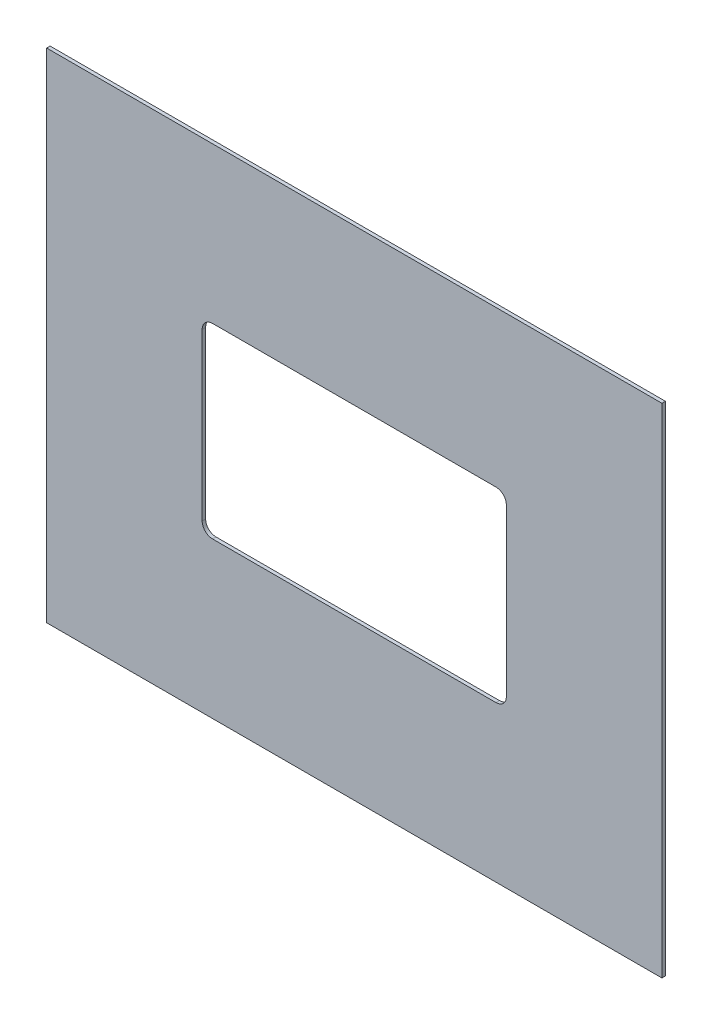
ISO-10303-21;
HEADER;
FILE_DESCRIPTION(('STEP AP214'),'2;1');
FILE_NAME('part.step','',(''),(''),'','','');
FILE_SCHEMA(('AUTOMOTIVE_DESIGN { 1 0 10303 214 1 1 1 1 }'));
ENDSEC;
DATA;
#1=APPLICATION_CONTEXT('core data for automotive mechanical design processes');
#2=APPLICATION_PROTOCOL_DEFINITION('international standard','automotive_design',2000,#1);
#3=PRODUCT_CONTEXT('',#1,'mechanical');
#4=PRODUCT('Part','Part','',(#3));
#5=PRODUCT_RELATED_PRODUCT_CATEGORY('part','',(#4));
#6=PRODUCT_DEFINITION_FORMATION('','',#4);
#7=PRODUCT_DEFINITION_CONTEXT('part definition',#1,'design');
#8=PRODUCT_DEFINITION('design','',#6,#7);
#9=PRODUCT_DEFINITION_SHAPE('','',#8);
#10=(LENGTH_UNIT() NAMED_UNIT(*) SI_UNIT(.MILLI.,.METRE.));
#11=(NAMED_UNIT(*) PLANE_ANGLE_UNIT() SI_UNIT($,.RADIAN.));
#12=(NAMED_UNIT(*) SI_UNIT($,.STERADIAN.) SOLID_ANGLE_UNIT());
#13=UNCERTAINTY_MEASURE_WITH_UNIT(LENGTH_MEASURE(1.E-05),#10,'distance_accuracy_value','');
#14=(GEOMETRIC_REPRESENTATION_CONTEXT(3) GLOBAL_UNCERTAINTY_ASSIGNED_CONTEXT((#13)) GLOBAL_UNIT_ASSIGNED_CONTEXT((#10,
#11,#12)) REPRESENTATION_CONTEXT('',''));
#15=CARTESIAN_POINT('',(0.,0.,0.));
#16=DIRECTION('',(0.,0.,1.));
#17=DIRECTION('',(1.,0.,0.));
#18=AXIS2_PLACEMENT_3D('',#15,#16,#17);
#19=CARTESIAN_POINT('',(0.,0.,1.));
#20=DIRECTION('',(0.,0.,1.));
#21=DIRECTION('',(1.,0.,0.));
#22=AXIS2_PLACEMENT_3D('',#19,#20,#21);
#23=PLANE('',#22);
#24=DIRECTION('',(0.,-1.,0.));
#25=VECTOR('',#24,1.);
#26=CARTESIAN_POINT('',(-86.6122108598411,61.3505191054714,1.));
#27=LINE('',#26,#25);
#28=CARTESIAN_POINT('',(-86.6122108598411,61.3505191054714,1.));
#29=VERTEX_POINT('',#28);
#30=CARTESIAN_POINT('',(-86.6122108598411,-82.6494808945286,1.));
#31=VERTEX_POINT('',#30);
#32=EDGE_CURVE('E187',#29,#31,#27,.T.);
#33=ORIENTED_EDGE('',*,*,#32,.T.);
#34=DIRECTION('',(1.,0.,0.));
#35=VECTOR('',#34,1.);
#36=CARTESIAN_POINT('',(-86.6122108598411,-82.6494808945286,1.));
#37=LINE('',#36,#35);
#38=CARTESIAN_POINT('',(91.3877891401589,-82.6494808945286,1.));
#39=VERTEX_POINT('',#38);
#40=EDGE_CURVE('E190',#31,#39,#37,.T.);
#41=ORIENTED_EDGE('',*,*,#40,.T.);
#42=DIRECTION('',(0.,1.,0.));
#43=VECTOR('',#42,1.);
#44=CARTESIAN_POINT('',(91.3877891401589,61.3505191054714,1.));
#45=LINE('',#44,#43);
#46=CARTESIAN_POINT('',(91.3877891401589,61.3505191054714,1.));
#47=VERTEX_POINT('',#46);
#48=EDGE_CURVE('E193',#39,#47,#45,.T.);
#49=ORIENTED_EDGE('',*,*,#48,.T.);
#50=DIRECTION('',(-1.,0.,0.));
#51=VECTOR('',#50,1.);
#52=CARTESIAN_POINT('',(-86.6122108598411,61.3505191054714,1.));
#53=LINE('',#52,#51);
#54=EDGE_CURVE('E195',#47,#29,#53,.T.);
#55=ORIENTED_EDGE('',*,*,#54,.T.);
#56=EDGE_LOOP('',(#33,#41,#49,#55));
#57=FACE_BOUND('',#56,.T.);
#58=DIRECTION('',(1.,0.,0.));
#59=VECTOR('',#58,1.);
#60=CARTESIAN_POINT('',(-38.612210859841,-37.6494808945286,1.));
#61=LINE('',#60,#59);
#62=CARTESIAN_POINT('',(-38.612210859841,-37.6494808945286,1.));
#63=VERTEX_POINT('',#62);
#64=CARTESIAN_POINT('',(43.3877891401589,-37.6494808945286,1.));
#65=VERTEX_POINT('',#64);
#66=EDGE_CURVE('E130',#63,#65,#61,.T.);
#67=ORIENTED_EDGE('',*,*,#66,.F.);
#68=CARTESIAN_POINT('',(-38.6122108598411,-34.6494808945286,1.));
#69=DIRECTION('',(0.,0.,1.));
#70=DIRECTION('',(1.,0.,0.));
#71=AXIS2_PLACEMENT_3D('',#68,#69,#70);
#72=CIRCLE('',#71,3.);
#73=CARTESIAN_POINT('',(-41.6122108598411,-34.6494808945285,1.));
#74=VERTEX_POINT('',#73);
#75=EDGE_CURVE('E122',#74,#63,#72,.T.);
#76=ORIENTED_EDGE('',*,*,#75,.F.);
#77=DIRECTION('',(0.,-1.,0.));
#78=VECTOR('',#77,1.);
#79=CARTESIAN_POINT('',(-41.6122108598411,13.3505191054714,1.));
#80=LINE('',#79,#78);
#81=CARTESIAN_POINT('',(-41.6122108598411,13.3505191054714,1.));
#82=VERTEX_POINT('',#81);
#83=EDGE_CURVE('E155',#82,#74,#80,.T.);
#84=ORIENTED_EDGE('',*,*,#83,.F.);
#85=CARTESIAN_POINT('',(-38.6122108598411,13.3505191054714,1.));
#86=DIRECTION('',(0.,0.,1.));
#87=DIRECTION('',(1.,0.,0.));
#88=AXIS2_PLACEMENT_3D('',#85,#86,#87);
#89=CIRCLE('',#88,3.);
#90=CARTESIAN_POINT('',(-38.612210859841,16.3505191054714,1.));
#91=VERTEX_POINT('',#90);
#92=EDGE_CURVE('E153',#91,#82,#89,.T.);
#93=ORIENTED_EDGE('',*,*,#92,.F.);
#94=DIRECTION('',(-1.,0.,0.));
#95=VECTOR('',#94,1.);
#96=CARTESIAN_POINT('',(-38.612210859841,16.3505191054714,1.));
#97=LINE('',#96,#95);
#98=CARTESIAN_POINT('',(43.3877891401589,16.3505191054714,1.));
#99=VERTEX_POINT('',#98);
#100=EDGE_CURVE('E151',#99,#91,#97,.T.);
#101=ORIENTED_EDGE('',*,*,#100,.F.);
#102=CARTESIAN_POINT('',(43.3877891401589,13.3505191054714,1.));
#103=DIRECTION('',(0.,0.,1.));
#104=DIRECTION('',(-1.,0.,0.));
#105=AXIS2_PLACEMENT_3D('',#102,#103,#104);
#106=CIRCLE('',#105,3.);
#107=CARTESIAN_POINT('',(46.3877891401589,13.3505191054714,1.));
#108=VERTEX_POINT('',#107);
#109=EDGE_CURVE('E149',#108,#99,#106,.T.);
#110=ORIENTED_EDGE('',*,*,#109,.F.);
#111=DIRECTION('',(0.,1.,0.));
#112=VECTOR('',#111,1.);
#113=CARTESIAN_POINT('',(46.3877891401589,13.3505191054714,1.));
#114=LINE('',#113,#112);
#115=CARTESIAN_POINT('',(46.3877891401589,-34.6494808945285,1.));
#116=VERTEX_POINT('',#115);
#117=EDGE_CURVE('E145',#116,#108,#114,.T.);
#118=ORIENTED_EDGE('',*,*,#117,.F.);
#119=CARTESIAN_POINT('',(43.3877891401589,-34.6494808945286,1.));
#120=DIRECTION('',(0.,0.,1.));
#121=DIRECTION('',(1.,0.,0.));
#122=AXIS2_PLACEMENT_3D('',#119,#120,#121);
#123=CIRCLE('',#122,3.);
#124=EDGE_CURVE('E143',#65,#116,#123,.T.);
#125=ORIENTED_EDGE('',*,*,#124,.F.);
#126=EDGE_LOOP('',(#67,#76,#84,#93,#101,#110,#118,#125));
#127=FACE_BOUND('',#126,.T.);
#128=ADVANCED_FACE('F33',(#57,#127),#23,.T.);
#129=CARTESIAN_POINT('',(0.,0.,0.));
#130=DIRECTION('',(0.,0.,1.));
#131=DIRECTION('',(1.,0.,0.));
#132=AXIS2_PLACEMENT_3D('',#129,#130,#131);
#133=PLANE('',#132);
#134=DIRECTION('',(0.,-1.,0.));
#135=VECTOR('',#134,1.);
#136=CARTESIAN_POINT('',(-86.6122108598411,61.3505191054714,0.));
#137=LINE('',#136,#135);
#138=CARTESIAN_POINT('',(-86.6122108598411,61.3505191054714,0.));
#139=VERTEX_POINT('',#138);
#140=CARTESIAN_POINT('',(-86.6122108598411,-82.6494808945286,0.));
#141=VERTEX_POINT('',#140);
#142=EDGE_CURVE('E138',#139,#141,#137,.T.);
#143=ORIENTED_EDGE('',*,*,#142,.F.);
#144=DIRECTION('',(-1.,0.,0.));
#145=VECTOR('',#144,1.);
#146=CARTESIAN_POINT('',(-86.6122108598411,61.3505191054714,0.));
#147=LINE('',#146,#145);
#148=CARTESIAN_POINT('',(91.3877891401589,61.3505191054714,0.));
#149=VERTEX_POINT('',#148);
#150=EDGE_CURVE('E191',#149,#139,#147,.T.);
#151=ORIENTED_EDGE('',*,*,#150,.F.);
#152=DIRECTION('',(0.,1.,0.));
#153=VECTOR('',#152,1.);
#154=CARTESIAN_POINT('',(91.3877891401589,61.3505191054714,0.));
#155=LINE('',#154,#153);
#156=CARTESIAN_POINT('',(91.3877891401589,-82.6494808945286,0.));
#157=VERTEX_POINT('',#156);
#158=EDGE_CURVE('E202',#157,#149,#155,.T.);
#159=ORIENTED_EDGE('',*,*,#158,.F.);
#160=DIRECTION('',(1.,0.,0.));
#161=VECTOR('',#160,1.);
#162=CARTESIAN_POINT('',(-86.6122108598411,-82.6494808945286,0.));
#163=LINE('',#162,#161);
#164=EDGE_CURVE('E200',#141,#157,#163,.T.);
#165=ORIENTED_EDGE('',*,*,#164,.F.);
#166=EDGE_LOOP('',(#143,#151,#159,#165));
#167=FACE_BOUND('',#166,.T.);
#168=CARTESIAN_POINT('',(-38.6122108598411,-34.6494808945286,0.));
#169=DIRECTION('',(0.,0.,1.));
#170=DIRECTION('',(1.,0.,0.));
#171=AXIS2_PLACEMENT_3D('',#168,#169,#170);
#172=CIRCLE('',#171,3.);
#173=CARTESIAN_POINT('',(-41.6122108598411,-34.6494808945285,0.));
#174=VERTEX_POINT('',#173);
#175=CARTESIAN_POINT('',(-38.612210859841,-37.6494808945286,0.));
#176=VERTEX_POINT('',#175);
#177=EDGE_CURVE('E56',#174,#176,#172,.T.);
#178=ORIENTED_EDGE('',*,*,#177,.T.);
#179=DIRECTION('',(1.,0.,0.));
#180=VECTOR('',#179,1.);
#181=CARTESIAN_POINT('',(-38.612210859841,-37.6494808945286,0.));
#182=LINE('',#181,#180);
#183=CARTESIAN_POINT('',(43.3877891401589,-37.6494808945286,0.));
#184=VERTEX_POINT('',#183);
#185=EDGE_CURVE('E137',#176,#184,#182,.T.);
#186=ORIENTED_EDGE('',*,*,#185,.T.);
#187=CARTESIAN_POINT('',(43.3877891401589,-34.6494808945286,0.));
#188=DIRECTION('',(0.,0.,1.));
#189=DIRECTION('',(1.,0.,0.));
#190=AXIS2_PLACEMENT_3D('',#187,#188,#189);
#191=CIRCLE('',#190,3.);
#192=CARTESIAN_POINT('',(46.3877891401589,-34.6494808945285,0.));
#193=VERTEX_POINT('',#192);
#194=EDGE_CURVE('E159',#184,#193,#191,.T.);
#195=ORIENTED_EDGE('',*,*,#194,.T.);
#196=DIRECTION('',(0.,1.,0.));
#197=VECTOR('',#196,1.);
#198=CARTESIAN_POINT('',(46.3877891401589,13.3505191054714,0.));
#199=LINE('',#198,#197);
#200=CARTESIAN_POINT('',(46.3877891401589,13.3505191054714,0.));
#201=VERTEX_POINT('',#200);
#202=EDGE_CURVE('E162',#193,#201,#199,.T.);
#203=ORIENTED_EDGE('',*,*,#202,.T.);
#204=CARTESIAN_POINT('',(43.3877891401589,13.3505191054714,0.));
#205=DIRECTION('',(0.,0.,1.));
#206=DIRECTION('',(-1.,0.,0.));
#207=AXIS2_PLACEMENT_3D('',#204,#205,#206);
#208=CIRCLE('',#207,3.);
#209=CARTESIAN_POINT('',(43.3877891401589,16.3505191054714,0.));
#210=VERTEX_POINT('',#209);
#211=EDGE_CURVE('E165',#201,#210,#208,.T.);
#212=ORIENTED_EDGE('',*,*,#211,.T.);
#213=DIRECTION('',(-1.,0.,0.));
#214=VECTOR('',#213,1.);
#215=CARTESIAN_POINT('',(-38.612210859841,16.3505191054714,0.));
#216=LINE('',#215,#214);
#217=CARTESIAN_POINT('',(-38.612210859841,16.3505191054714,0.));
#218=VERTEX_POINT('',#217);
#219=EDGE_CURVE('E168',#210,#218,#216,.T.);
#220=ORIENTED_EDGE('',*,*,#219,.T.);
#221=CARTESIAN_POINT('',(-38.6122108598411,13.3505191054714,0.));
#222=DIRECTION('',(0.,0.,1.));
#223=DIRECTION('',(1.,0.,0.));
#224=AXIS2_PLACEMENT_3D('',#221,#222,#223);
#225=CIRCLE('',#224,3.);
#226=CARTESIAN_POINT('',(-41.6122108598411,13.3505191054714,0.));
#227=VERTEX_POINT('',#226);
#228=EDGE_CURVE('E171',#218,#227,#225,.T.);
#229=ORIENTED_EDGE('',*,*,#228,.T.);
#230=DIRECTION('',(0.,-1.,0.));
#231=VECTOR('',#230,1.);
#232=CARTESIAN_POINT('',(-41.6122108598411,13.3505191054714,0.));
#233=LINE('',#232,#231);
#234=EDGE_CURVE('E131',#227,#174,#233,.T.);
#235=ORIENTED_EDGE('',*,*,#234,.T.);
#236=EDGE_LOOP('',(#178,#186,#195,#203,#212,#220,#229,#235));
#237=FACE_BOUND('',#236,.T.);
#238=ADVANCED_FACE('F220',(#167,#237),#133,.F.);
#239=CARTESIAN_POINT('',(-86.6122108598411,61.3505191054714,1.));
#240=DIRECTION('',(1.,0.,0.));
#241=DIRECTION('',(0.,0.,-1.));
#242=AXIS2_PLACEMENT_3D('',#239,#240,#241);
#243=PLANE('',#242);
#244=ORIENTED_EDGE('',*,*,#142,.T.);
#245=DIRECTION('',(0.,0.,-1.));
#246=VECTOR('',#245,1.);
#247=CARTESIAN_POINT('',(-86.6122108598411,-82.6494808945286,1.));
#248=LINE('',#247,#246);
#249=EDGE_CURVE('E11',#31,#141,#248,.T.);
#250=ORIENTED_EDGE('',*,*,#249,.F.);
#251=ORIENTED_EDGE('',*,*,#32,.F.);
#252=DIRECTION('',(0.,0.,-1.));
#253=VECTOR('',#252,1.);
#254=CARTESIAN_POINT('',(-86.6122108598411,61.3505191054714,1.));
#255=LINE('',#254,#253);
#256=EDGE_CURVE('E197',#29,#139,#255,.T.);
#257=ORIENTED_EDGE('',*,*,#256,.T.);
#258=EDGE_LOOP('',(#244,#250,#251,#257));
#259=FACE_BOUND('',#258,.T.);
#260=ADVANCED_FACE('F35',(#259),#243,.F.);
#261=CARTESIAN_POINT('',(-86.6122108598411,-82.6494808945286,1.));
#262=DIRECTION('',(0.,1.,0.));
#263=DIRECTION('',(0.,0.,1.));
#264=AXIS2_PLACEMENT_3D('',#261,#262,#263);
#265=PLANE('',#264);
#266=ORIENTED_EDGE('',*,*,#164,.T.);
#267=DIRECTION('',(0.,0.,-1.));
#268=VECTOR('',#267,1.);
#269=CARTESIAN_POINT('',(91.3877891401589,-82.6494808945286,1.));
#270=LINE('',#269,#268);
#271=EDGE_CURVE('E41',#39,#157,#270,.T.);
#272=ORIENTED_EDGE('',*,*,#271,.F.);
#273=ORIENTED_EDGE('',*,*,#40,.F.);
#274=ORIENTED_EDGE('',*,*,#249,.T.);
#275=EDGE_LOOP('',(#266,#272,#273,#274));
#276=FACE_BOUND('',#275,.T.);
#277=ADVANCED_FACE('F230',(#276),#265,.F.);
#278=CARTESIAN_POINT('',(91.3877891401589,61.3505191054714,1.));
#279=DIRECTION('',(-1.,0.,0.));
#280=DIRECTION('',(0.,0.,1.));
#281=AXIS2_PLACEMENT_3D('',#278,#279,#280);
#282=PLANE('',#281);
#283=ORIENTED_EDGE('',*,*,#158,.T.);
#284=DIRECTION('',(0.,0.,-1.));
#285=VECTOR('',#284,1.);
#286=CARTESIAN_POINT('',(91.3877891401589,61.3505191054714,1.));
#287=LINE('',#286,#285);
#288=EDGE_CURVE('E207',#47,#149,#287,.T.);
#289=ORIENTED_EDGE('',*,*,#288,.F.);
#290=ORIENTED_EDGE('',*,*,#48,.F.);
#291=ORIENTED_EDGE('',*,*,#271,.T.);
#292=EDGE_LOOP('',(#283,#289,#290,#291));
#293=FACE_BOUND('',#292,.T.);
#294=ADVANCED_FACE('F214',(#293),#282,.F.);
#295=CARTESIAN_POINT('',(-86.6122108598411,61.3505191054714,1.));
#296=DIRECTION('',(0.,-1.,0.));
#297=DIRECTION('',(0.,0.,-1.));
#298=AXIS2_PLACEMENT_3D('',#295,#296,#297);
#299=PLANE('',#298);
#300=ORIENTED_EDGE('',*,*,#150,.T.);
#301=ORIENTED_EDGE('',*,*,#256,.F.);
#302=ORIENTED_EDGE('',*,*,#54,.F.);
#303=ORIENTED_EDGE('',*,*,#288,.T.);
#304=EDGE_LOOP('',(#300,#301,#302,#303));
#305=FACE_BOUND('',#304,.T.);
#306=ADVANCED_FACE('F224',(#305),#299,.F.);
#307=CARTESIAN_POINT('',(-38.6122108598411,-34.6494808945286,1.));
#308=DIRECTION('',(0.,0.,-1.));
#309=DIRECTION('',(-1.,0.,0.));
#310=AXIS2_PLACEMENT_3D('',#307,#308,#309);
#311=CYLINDRICAL_SURFACE('',#310,3.);
#312=ORIENTED_EDGE('',*,*,#177,.F.);
#313=DIRECTION('',(0.,0.,-1.));
#314=VECTOR('',#313,1.);
#315=CARTESIAN_POINT('',(-41.6122108598411,-34.6494808945285,1.));
#316=LINE('',#315,#314);
#317=EDGE_CURVE('E126',#74,#174,#316,.T.);
#318=ORIENTED_EDGE('',*,*,#317,.F.);
#319=ORIENTED_EDGE('',*,*,#75,.T.);
#320=DIRECTION('',(0.,0.,-1.));
#321=VECTOR('',#320,1.);
#322=CARTESIAN_POINT('',(-38.612210859841,-37.6494808945286,1.));
#323=LINE('',#322,#321);
#324=EDGE_CURVE('E125',#63,#176,#323,.T.);
#325=ORIENTED_EDGE('',*,*,#324,.T.);
#326=EDGE_LOOP('',(#312,#318,#319,#325));
#327=FACE_BOUND('',#326,.T.);
#328=ADVANCED_FACE('F124',(#327),#311,.F.);
#329=CARTESIAN_POINT('',(-38.612210859841,-37.6494808945286,1.));
#330=DIRECTION('',(0.,1.,0.));
#331=DIRECTION('',(0.,0.,1.));
#332=AXIS2_PLACEMENT_3D('',#329,#330,#331);
#333=PLANE('',#332);
#334=ORIENTED_EDGE('',*,*,#185,.F.);
#335=ORIENTED_EDGE('',*,*,#324,.F.);
#336=ORIENTED_EDGE('',*,*,#66,.T.);
#337=DIRECTION('',(0.,0.,-1.));
#338=VECTOR('',#337,1.);
#339=CARTESIAN_POINT('',(43.3877891401589,-37.6494808945286,1.));
#340=LINE('',#339,#338);
#341=EDGE_CURVE('E139',#65,#184,#340,.T.);
#342=ORIENTED_EDGE('',*,*,#341,.T.);
#343=EDGE_LOOP('',(#334,#335,#336,#342));
#344=FACE_BOUND('',#343,.T.);
#345=ADVANCED_FACE('F134',(#344),#333,.T.);
#346=CARTESIAN_POINT('',(43.3877891401589,-34.6494808945286,1.));
#347=DIRECTION('',(0.,0.,-1.));
#348=DIRECTION('',(-1.,0.,0.));
#349=AXIS2_PLACEMENT_3D('',#346,#347,#348);
#350=CYLINDRICAL_SURFACE('',#349,3.);
#351=ORIENTED_EDGE('',*,*,#194,.F.);
#352=ORIENTED_EDGE('',*,*,#341,.F.);
#353=ORIENTED_EDGE('',*,*,#124,.T.);
#354=DIRECTION('',(0.,0.,-1.));
#355=VECTOR('',#354,1.);
#356=CARTESIAN_POINT('',(46.3877891401589,-34.6494808945285,1.));
#357=LINE('',#356,#355);
#358=EDGE_CURVE('E184',#116,#193,#357,.T.);
#359=ORIENTED_EDGE('',*,*,#358,.T.);
#360=EDGE_LOOP('',(#351,#352,#353,#359));
#361=FACE_BOUND('',#360,.T.);
#362=ADVANCED_FACE('F253',(#361),#350,.F.);
#363=CARTESIAN_POINT('',(46.3877891401589,13.3505191054714,1.));
#364=DIRECTION('',(-1.,0.,0.));
#365=DIRECTION('',(0.,-1.,0.));
#366=AXIS2_PLACEMENT_3D('',#363,#364,#365);
#367=PLANE('',#366);
#368=ORIENTED_EDGE('',*,*,#202,.F.);
#369=ORIENTED_EDGE('',*,*,#358,.F.);
#370=ORIENTED_EDGE('',*,*,#117,.T.);
#371=DIRECTION('',(0.,0.,-1.));
#372=VECTOR('',#371,1.);
#373=CARTESIAN_POINT('',(46.3877891401589,13.3505191054714,1.));
#374=LINE('',#373,#372);
#375=EDGE_CURVE('E182',#108,#201,#374,.T.);
#376=ORIENTED_EDGE('',*,*,#375,.T.);
#377=EDGE_LOOP('',(#368,#369,#370,#376));
#378=FACE_BOUND('',#377,.T.);
#379=ADVANCED_FACE('F257',(#378),#367,.T.);
#380=CARTESIAN_POINT('',(43.3877891401589,13.3505191054714,1.));
#381=DIRECTION('',(0.,0.,-1.));
#382=DIRECTION('',(-1.,0.,0.));
#383=AXIS2_PLACEMENT_3D('',#380,#381,#382);
#384=CYLINDRICAL_SURFACE('',#383,3.);
#385=ORIENTED_EDGE('',*,*,#211,.F.);
#386=ORIENTED_EDGE('',*,*,#375,.F.);
#387=ORIENTED_EDGE('',*,*,#109,.T.);
#388=DIRECTION('',(0.,0.,-1.));
#389=VECTOR('',#388,1.);
#390=CARTESIAN_POINT('',(43.3877891401589,16.3505191054714,1.));
#391=LINE('',#390,#389);
#392=EDGE_CURVE('E180',#99,#210,#391,.T.);
#393=ORIENTED_EDGE('',*,*,#392,.T.);
#394=EDGE_LOOP('',(#385,#386,#387,#393));
#395=FACE_BOUND('',#394,.T.);
#396=ADVANCED_FACE('F263',(#395),#384,.F.);
#397=CARTESIAN_POINT('',(-38.612210859841,16.3505191054714,1.));
#398=DIRECTION('',(0.,-1.,0.));
#399=DIRECTION('',(0.,0.,-1.));
#400=AXIS2_PLACEMENT_3D('',#397,#398,#399);
#401=PLANE('',#400);
#402=ORIENTED_EDGE('',*,*,#219,.F.);
#403=ORIENTED_EDGE('',*,*,#392,.F.);
#404=ORIENTED_EDGE('',*,*,#100,.T.);
#405=DIRECTION('',(0.,0.,-1.));
#406=VECTOR('',#405,1.);
#407=CARTESIAN_POINT('',(-38.612210859841,16.3505191054714,1.));
#408=LINE('',#407,#406);
#409=EDGE_CURVE('E178',#91,#218,#408,.T.);
#410=ORIENTED_EDGE('',*,*,#409,.T.);
#411=EDGE_LOOP('',(#402,#403,#404,#410));
#412=FACE_BOUND('',#411,.T.);
#413=ADVANCED_FACE('F267',(#412),#401,.T.);
#414=CARTESIAN_POINT('',(-38.6122108598411,13.3505191054714,1.));
#415=DIRECTION('',(0.,0.,-1.));
#416=DIRECTION('',(-1.,0.,0.));
#417=AXIS2_PLACEMENT_3D('',#414,#415,#416);
#418=CYLINDRICAL_SURFACE('',#417,3.);
#419=ORIENTED_EDGE('',*,*,#228,.F.);
#420=ORIENTED_EDGE('',*,*,#409,.F.);
#421=ORIENTED_EDGE('',*,*,#92,.T.);
#422=DIRECTION('',(0.,0.,-1.));
#423=VECTOR('',#422,1.);
#424=CARTESIAN_POINT('',(-41.6122108598411,13.3505191054714,1.));
#425=LINE('',#424,#423);
#426=EDGE_CURVE('E48',#82,#227,#425,.T.);
#427=ORIENTED_EDGE('',*,*,#426,.T.);
#428=EDGE_LOOP('',(#419,#420,#421,#427));
#429=FACE_BOUND('',#428,.T.);
#430=ADVANCED_FACE('F271',(#429),#418,.F.);
#431=CARTESIAN_POINT('',(-41.6122108598411,13.3505191054714,1.));
#432=DIRECTION('',(1.,0.,0.));
#433=DIRECTION('',(0.,0.,-1.));
#434=AXIS2_PLACEMENT_3D('',#431,#432,#433);
#435=PLANE('',#434);
#436=ORIENTED_EDGE('',*,*,#234,.F.);
#437=ORIENTED_EDGE('',*,*,#426,.F.);
#438=ORIENTED_EDGE('',*,*,#83,.T.);
#439=ORIENTED_EDGE('',*,*,#317,.T.);
#440=EDGE_LOOP('',(#436,#437,#438,#439));
#441=FACE_BOUND('',#440,.T.);
#442=ADVANCED_FACE('F275',(#441),#435,.T.);
#443=CLOSED_SHELL('',(#128,#238,#260,#277,#294,#306,#328,#345,#362,#379,#396,#413,#430,#442));
#444=MANIFOLD_SOLID_BREP('B2',#443);
#445=ADVANCED_BREP_SHAPE_REPRESENTATION('',(#18,#444),#14);
#446=SHAPE_DEFINITION_REPRESENTATION(#9,#445);
ENDSEC;
END-ISO-10303-21;
